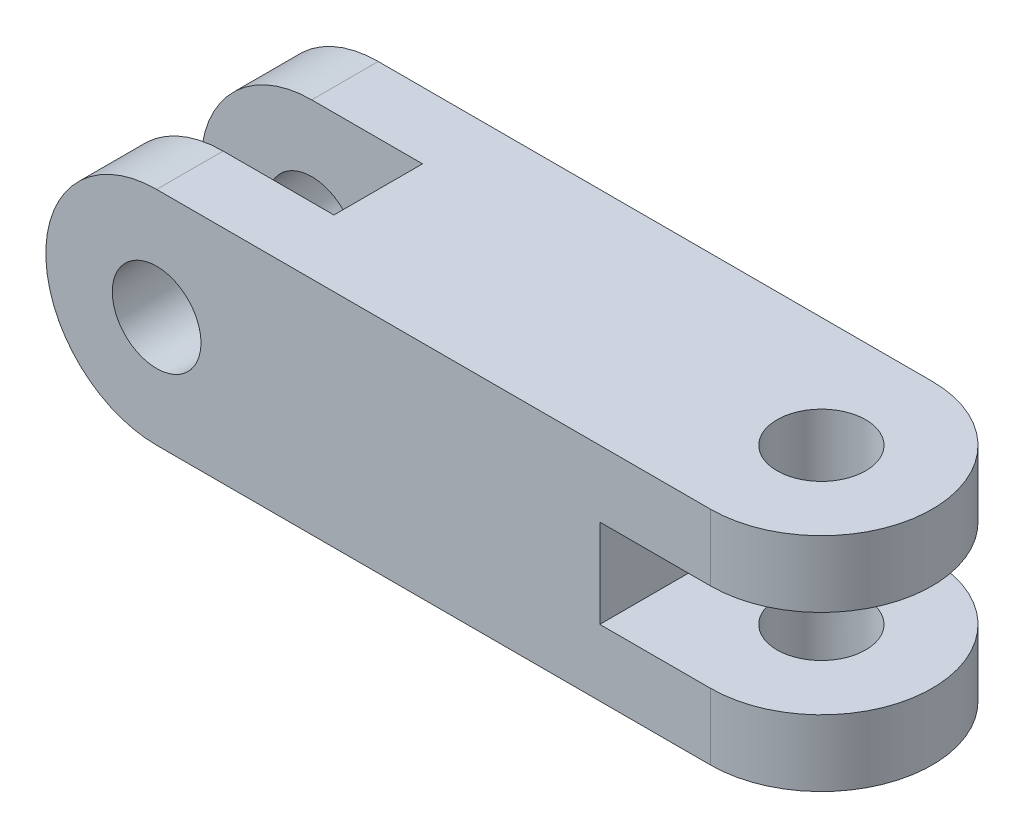
ISO-10303-21;
HEADER;
FILE_DESCRIPTION(('STEP AP214'),'2;1');
FILE_NAME('part.step','',(''),(''),'','','');
FILE_SCHEMA(('AUTOMOTIVE_DESIGN { 1 0 10303 214 1 1 1 1 }'));
ENDSEC;
DATA;
#1=APPLICATION_CONTEXT('core data for automotive mechanical design processes');
#2=APPLICATION_PROTOCOL_DEFINITION('international standard','automotive_design',2000,#1);
#3=PRODUCT_CONTEXT('',#1,'mechanical');
#4=PRODUCT('Part','Part','',(#3));
#5=PRODUCT_RELATED_PRODUCT_CATEGORY('part','',(#4));
#6=PRODUCT_DEFINITION_FORMATION('','',#4);
#7=PRODUCT_DEFINITION_CONTEXT('part definition',#1,'design');
#8=PRODUCT_DEFINITION('design','',#6,#7);
#9=PRODUCT_DEFINITION_SHAPE('','',#8);
#10=(LENGTH_UNIT() NAMED_UNIT(*) SI_UNIT(.MILLI.,.METRE.));
#11=(NAMED_UNIT(*) PLANE_ANGLE_UNIT() SI_UNIT($,.RADIAN.));
#12=(NAMED_UNIT(*) SI_UNIT($,.STERADIAN.) SOLID_ANGLE_UNIT());
#13=UNCERTAINTY_MEASURE_WITH_UNIT(LENGTH_MEASURE(1.E-05),#10,'distance_accuracy_value','');
#14=(GEOMETRIC_REPRESENTATION_CONTEXT(3) GLOBAL_UNCERTAINTY_ASSIGNED_CONTEXT((#13)) GLOBAL_UNIT_ASSIGNED_CONTEXT((#10,
#11,#12)) REPRESENTATION_CONTEXT('',''));
#15=CARTESIAN_POINT('',(0.,0.,0.));
#16=DIRECTION('',(0.,0.,1.));
#17=DIRECTION('',(1.,0.,0.));
#18=AXIS2_PLACEMENT_3D('',#15,#16,#17);
#19=CARTESIAN_POINT('',(65.,50.,0.));
#20=DIRECTION('',(0.,-1.,0.));
#21=DIRECTION('',(0.,0.,-1.));
#22=AXIS2_PLACEMENT_3D('',#19,#20,#21);
#23=CYLINDRICAL_SURFACE('',#22,25.);
#24=DIRECTION('',(0.,-1.,0.));
#25=VECTOR('',#24,1.);
#26=CARTESIAN_POINT('',(65.,50.,-25.));
#27=LINE('',#26,#25);
#28=CARTESIAN_POINT('',(65.,15.,-25.));
#29=VERTEX_POINT('',#28);
#30=CARTESIAN_POINT('',(65.,0.,-25.));
#31=VERTEX_POINT('',#30);
#32=EDGE_CURVE('E214',#29,#31,#27,.T.);
#33=ORIENTED_EDGE('',*,*,#32,.F.);
#34=CARTESIAN_POINT('',(65.,15.,0.));
#35=DIRECTION('',(0.,-1.,0.));
#36=DIRECTION('',(0.,0.,-1.));
#37=AXIS2_PLACEMENT_3D('',#34,#35,#36);
#38=CIRCLE('',#37,25.);
#39=CARTESIAN_POINT('',(65.,15.,25.));
#40=VERTEX_POINT('',#39);
#41=EDGE_CURVE('E164',#29,#40,#38,.T.);
#42=ORIENTED_EDGE('',*,*,#41,.T.);
#43=DIRECTION('',(0.,-1.,0.));
#44=VECTOR('',#43,1.);
#45=CARTESIAN_POINT('',(65.,50.,25.));
#46=LINE('',#45,#44);
#47=CARTESIAN_POINT('',(65.,0.,25.));
#48=VERTEX_POINT('',#47);
#49=EDGE_CURVE('E77',#40,#48,#46,.T.);
#50=ORIENTED_EDGE('',*,*,#49,.T.);
#51=CARTESIAN_POINT('',(65.,0.,0.));
#52=DIRECTION('',(0.,1.,0.));
#53=DIRECTION('',(0.,0.,1.));
#54=AXIS2_PLACEMENT_3D('',#51,#52,#53);
#55=CIRCLE('',#54,25.);
#56=EDGE_CURVE('E191',#48,#31,#55,.T.);
#57=ORIENTED_EDGE('',*,*,#56,.T.);
#58=EDGE_LOOP('',(#33,#42,#50,#57));
#59=FACE_BOUND('',#58,.T.);
#60=ADVANCED_FACE('F33',(#59),#23,.T.);
#61=CARTESIAN_POINT('',(-60.,25.,-25.));
#62=DIRECTION('',(0.,0.,1.));
#63=DIRECTION('',(1.,0.,0.));
#64=AXIS2_PLACEMENT_3D('',#61,#62,#63);
#65=CYLINDRICAL_SURFACE('',#64,25.);
#66=DIRECTION('',(0.,0.,1.));
#67=VECTOR('',#66,1.);
#68=CARTESIAN_POINT('',(-60.,0.,-25.));
#69=LINE('',#68,#67);
#70=CARTESIAN_POINT('',(-60.,0.,-25.));
#71=VERTEX_POINT('',#70);
#72=CARTESIAN_POINT('',(-60.,0.,-10.));
#73=VERTEX_POINT('',#72);
#74=EDGE_CURVE('E207',#71,#73,#69,.T.);
#75=ORIENTED_EDGE('',*,*,#74,.T.);
#76=CARTESIAN_POINT('',(-60.,25.,-10.));
#77=DIRECTION('',(0.,0.,-1.));
#78=DIRECTION('',(-1.,0.,0.));
#79=AXIS2_PLACEMENT_3D('',#76,#77,#78);
#80=CIRCLE('',#79,25.);
#81=CARTESIAN_POINT('',(-60.,50.,-10.));
#82=VERTEX_POINT('',#81);
#83=EDGE_CURVE('E42',#82,#73,#80,.F.);
#84=ORIENTED_EDGE('',*,*,#83,.F.);
#85=DIRECTION('',(0.,0.,1.));
#86=VECTOR('',#85,1.);
#87=CARTESIAN_POINT('',(-60.,50.,-25.));
#88=LINE('',#87,#86);
#89=CARTESIAN_POINT('',(-60.,50.,-25.));
#90=VERTEX_POINT('',#89);
#91=EDGE_CURVE('E199',#90,#82,#88,.T.);
#92=ORIENTED_EDGE('',*,*,#91,.F.);
#93=CARTESIAN_POINT('',(-60.,25.,-25.));
#94=DIRECTION('',(0.,0.,1.));
#95=DIRECTION('',(1.,0.,0.));
#96=AXIS2_PLACEMENT_3D('',#93,#94,#95);
#97=CIRCLE('',#96,25.);
#98=EDGE_CURVE('E188',#90,#71,#97,.T.);
#99=ORIENTED_EDGE('',*,*,#98,.T.);
#100=EDGE_LOOP('',(#75,#84,#92,#99));
#101=FACE_BOUND('',#100,.T.);
#102=ADVANCED_FACE('F262',(#101),#65,.T.);
#103=CARTESIAN_POINT('',(65.,50.,25.));
#104=VERTEX_POINT('',#103);
#105=CARTESIAN_POINT('',(65.,35.,25.));
#106=VERTEX_POINT('',#105);
#107=EDGE_CURVE('E211',#104,#106,#46,.T.);
#108=ORIENTED_EDGE('',*,*,#107,.T.);
#109=CARTESIAN_POINT('',(65.,35.,0.));
#110=DIRECTION('',(0.,1.,0.));
#111=DIRECTION('',(0.,0.,1.));
#112=AXIS2_PLACEMENT_3D('',#109,#110,#111);
#113=CIRCLE('',#112,25.);
#114=CARTESIAN_POINT('',(65.,35.,-25.));
#115=VERTEX_POINT('',#114);
#116=EDGE_CURVE('E50',#106,#115,#113,.T.);
#117=ORIENTED_EDGE('',*,*,#116,.T.);
#118=CARTESIAN_POINT('',(65.,50.,-25.));
#119=VERTEX_POINT('',#118);
#120=EDGE_CURVE('E150',#119,#115,#27,.T.);
#121=ORIENTED_EDGE('',*,*,#120,.F.);
#122=CARTESIAN_POINT('',(65.,50.,0.));
#123=DIRECTION('',(0.,1.,0.));
#124=DIRECTION('',(0.,0.,1.));
#125=AXIS2_PLACEMENT_3D('',#122,#123,#124);
#126=CIRCLE('',#125,25.);
#127=EDGE_CURVE('E194',#104,#119,#126,.T.);
#128=ORIENTED_EDGE('',*,*,#127,.F.);
#129=EDGE_LOOP('',(#108,#117,#121,#128));
#130=FACE_BOUND('',#129,.T.);
#131=ADVANCED_FACE('F35',(#130),#23,.T.);
#132=CARTESIAN_POINT('',(-60.,50.,-25.));
#133=DIRECTION('',(0.,0.,1.));
#134=DIRECTION('',(1.,0.,0.));
#135=AXIS2_PLACEMENT_3D('',#132,#133,#134);
#136=PLANE('',#135);
#137=CARTESIAN_POINT('',(-60.,25.,-25.));
#138=DIRECTION('',(0.,0.,-1.));
#139=DIRECTION('',(-1.,0.,0.));
#140=AXIS2_PLACEMENT_3D('',#137,#138,#139);
#141=CIRCLE('',#140,9.99999999999999);
#142=CARTESIAN_POINT('',(-70.,25.,-25.));
#143=VERTEX_POINT('',#142);
#144=EDGE_CURVE('E234',#143,#143,#141,.T.);
#145=ORIENTED_EDGE('',*,*,#144,.F.);
#146=EDGE_LOOP('',(#145));
#147=FACE_BOUND('',#146,.T.);
#148=DIRECTION('',(0.,-1.,0.));
#149=VECTOR('',#148,1.);
#150=CARTESIAN_POINT('',(40.,35.,-25.));
#151=LINE('',#150,#149);
#152=CARTESIAN_POINT('',(40.,35.,-25.));
#153=VERTEX_POINT('',#152);
#154=CARTESIAN_POINT('',(40.,15.,-25.));
#155=VERTEX_POINT('',#154);
#156=EDGE_CURVE('E143',#153,#155,#151,.T.);
#157=ORIENTED_EDGE('',*,*,#156,.T.);
#158=DIRECTION('',(1.,0.,0.));
#159=VECTOR('',#158,1.);
#160=CARTESIAN_POINT('',(90.,15.,-25.));
#161=LINE('',#160,#159);
#162=EDGE_CURVE('E140',#155,#29,#161,.T.);
#163=ORIENTED_EDGE('',*,*,#162,.T.);
#164=ORIENTED_EDGE('',*,*,#32,.T.);
#165=DIRECTION('',(-1.,0.,0.));
#166=VECTOR('',#165,1.);
#167=CARTESIAN_POINT('',(-60.,0.,-25.));
#168=LINE('',#167,#166);
#169=EDGE_CURVE('E204',#31,#71,#168,.T.);
#170=ORIENTED_EDGE('',*,*,#169,.T.);
#171=ORIENTED_EDGE('',*,*,#98,.F.);
#172=DIRECTION('',(-1.,0.,0.));
#173=VECTOR('',#172,1.);
#174=CARTESIAN_POINT('',(-60.,50.,-25.));
#175=LINE('',#174,#173);
#176=EDGE_CURVE('E85',#119,#90,#175,.T.);
#177=ORIENTED_EDGE('',*,*,#176,.F.);
#178=ORIENTED_EDGE('',*,*,#120,.T.);
#179=DIRECTION('',(-1.,0.,0.));
#180=VECTOR('',#179,1.);
#181=CARTESIAN_POINT('',(90.,35.,-25.));
#182=LINE('',#181,#180);
#183=EDGE_CURVE('E135',#115,#153,#182,.T.);
#184=ORIENTED_EDGE('',*,*,#183,.T.);
#185=EDGE_LOOP('',(#157,#163,#164,#170,#171,#177,#178,#184));
#186=FACE_BOUND('',#185,.T.);
#187=ADVANCED_FACE('F148',(#147,#186),#136,.F.);
#188=CARTESIAN_POINT('',(-60.,50.,25.));
#189=DIRECTION('',(0.,0.,-1.));
#190=DIRECTION('',(-1.,0.,0.));
#191=AXIS2_PLACEMENT_3D('',#188,#189,#190);
#192=PLANE('',#191);
#193=CARTESIAN_POINT('',(-60.,25.,25.));
#194=DIRECTION('',(0.,0.,-1.));
#195=DIRECTION('',(-1.,0.,0.));
#196=AXIS2_PLACEMENT_3D('',#193,#194,#195);
#197=CIRCLE('',#196,9.99999999999999);
#198=CARTESIAN_POINT('',(-70.,25.,25.));
#199=VERTEX_POINT('',#198);
#200=EDGE_CURVE('E237',#199,#199,#197,.T.);
#201=ORIENTED_EDGE('',*,*,#200,.T.);
#202=EDGE_LOOP('',(#201));
#203=FACE_BOUND('',#202,.T.);
#204=ORIENTED_EDGE('',*,*,#49,.F.);
#205=DIRECTION('',(1.,0.,0.));
#206=VECTOR('',#205,1.);
#207=CARTESIAN_POINT('',(90.,15.,25.));
#208=LINE('',#207,#206);
#209=CARTESIAN_POINT('',(40.,15.,25.));
#210=VERTEX_POINT('',#209);
#211=EDGE_CURVE('E151',#210,#40,#208,.T.);
#212=ORIENTED_EDGE('',*,*,#211,.F.);
#213=DIRECTION('',(0.,-1.,0.));
#214=VECTOR('',#213,1.);
#215=CARTESIAN_POINT('',(40.,35.,25.));
#216=LINE('',#215,#214);
#217=CARTESIAN_POINT('',(40.,35.,25.));
#218=VERTEX_POINT('',#217);
#219=EDGE_CURVE('E154',#218,#210,#216,.T.);
#220=ORIENTED_EDGE('',*,*,#219,.F.);
#221=DIRECTION('',(1.,0.,0.));
#222=VECTOR('',#221,1.);
#223=CARTESIAN_POINT('',(-60.,35.,25.));
#224=LINE('',#223,#222);
#225=EDGE_CURVE('E11',#218,#106,#224,.T.);
#226=ORIENTED_EDGE('',*,*,#225,.T.);
#227=ORIENTED_EDGE('',*,*,#107,.F.);
#228=DIRECTION('',(1.,0.,0.));
#229=VECTOR('',#228,1.);
#230=CARTESIAN_POINT('',(-60.,50.,25.));
#231=LINE('',#230,#229);
#232=CARTESIAN_POINT('',(-60.,50.,25.));
#233=VERTEX_POINT('',#232);
#234=EDGE_CURVE('E58',#233,#104,#231,.T.);
#235=ORIENTED_EDGE('',*,*,#234,.F.);
#236=CARTESIAN_POINT('',(-60.,25.,25.));
#237=DIRECTION('',(0.,0.,1.));
#238=DIRECTION('',(1.,0.,0.));
#239=AXIS2_PLACEMENT_3D('',#236,#237,#238);
#240=CIRCLE('',#239,25.);
#241=CARTESIAN_POINT('',(-60.,0.,25.));
#242=VERTEX_POINT('',#241);
#243=EDGE_CURVE('E185',#233,#242,#240,.T.);
#244=ORIENTED_EDGE('',*,*,#243,.T.);
#245=DIRECTION('',(1.,0.,0.));
#246=VECTOR('',#245,1.);
#247=CARTESIAN_POINT('',(-60.,0.,25.));
#248=LINE('',#247,#246);
#249=EDGE_CURVE('E196',#242,#48,#248,.T.);
#250=ORIENTED_EDGE('',*,*,#249,.T.);
#251=EDGE_LOOP('',(#204,#212,#220,#226,#227,#235,#244,#250));
#252=FACE_BOUND('',#251,.T.);
#253=ADVANCED_FACE('F275',(#203,#252),#192,.F.);
#254=CARTESIAN_POINT('',(65.,50.,0.));
#255=DIRECTION('',(0.,1.,0.));
#256=DIRECTION('',(0.,0.,1.));
#257=AXIS2_PLACEMENT_3D('',#254,#255,#256);
#258=PLANE('',#257);
#259=CARTESIAN_POINT('',(65.,50.,0.));
#260=DIRECTION('',(0.,1.,0.));
#261=DIRECTION('',(0.,0.,1.));
#262=AXIS2_PLACEMENT_3D('',#259,#260,#261);
#263=CIRCLE('',#262,9.99999999999999);
#264=CARTESIAN_POINT('',(65.,50.,9.99999999999999));
#265=VERTEX_POINT('',#264);
#266=EDGE_CURVE('E225',#265,#265,#263,.T.);
#267=ORIENTED_EDGE('',*,*,#266,.F.);
#268=EDGE_LOOP('',(#267));
#269=FACE_BOUND('',#268,.T.);
#270=DIRECTION('',(-1.,0.,0.));
#271=VECTOR('',#270,1.);
#272=CARTESIAN_POINT('',(-85.,50.,-10.));
#273=LINE('',#272,#271);
#274=CARTESIAN_POINT('',(-35.,50.,-10.));
#275=VERTEX_POINT('',#274);
#276=EDGE_CURVE('E171',#275,#82,#273,.T.);
#277=ORIENTED_EDGE('',*,*,#276,.F.);
#278=DIRECTION('',(0.,0.,-1.));
#279=VECTOR('',#278,1.);
#280=CARTESIAN_POINT('',(-35.,50.,-10.));
#281=LINE('',#280,#279);
#282=CARTESIAN_POINT('',(-35.,50.,9.99999999999999));
#283=VERTEX_POINT('',#282);
#284=EDGE_CURVE('E179',#283,#275,#281,.T.);
#285=ORIENTED_EDGE('',*,*,#284,.F.);
#286=DIRECTION('',(1.,0.,0.));
#287=VECTOR('',#286,1.);
#288=CARTESIAN_POINT('',(-85.,50.,9.99999999999999));
#289=LINE('',#288,#287);
#290=CARTESIAN_POINT('',(-60.,50.,9.99999999999999));
#291=VERTEX_POINT('',#290);
#292=EDGE_CURVE('E166',#291,#283,#289,.T.);
#293=ORIENTED_EDGE('',*,*,#292,.F.);
#294=EDGE_CURVE('E198',#291,#233,#88,.T.);
#295=ORIENTED_EDGE('',*,*,#294,.T.);
#296=ORIENTED_EDGE('',*,*,#234,.T.);
#297=ORIENTED_EDGE('',*,*,#127,.T.);
#298=ORIENTED_EDGE('',*,*,#176,.T.);
#299=ORIENTED_EDGE('',*,*,#91,.T.);
#300=EDGE_LOOP('',(#277,#285,#293,#295,#296,#297,#298,#299));
#301=FACE_BOUND('',#300,.T.);
#302=ADVANCED_FACE('F293',(#269,#301),#258,.T.);
#303=CARTESIAN_POINT('',(65.,0.,0.));
#304=DIRECTION('',(0.,1.,0.));
#305=DIRECTION('',(0.,0.,1.));
#306=AXIS2_PLACEMENT_3D('',#303,#304,#305);
#307=PLANE('',#306);
#308=CARTESIAN_POINT('',(65.,0.,0.));
#309=DIRECTION('',(0.,1.,0.));
#310=DIRECTION('',(0.,0.,1.));
#311=AXIS2_PLACEMENT_3D('',#308,#309,#310);
#312=CIRCLE('',#311,9.99999999999999);
#313=CARTESIAN_POINT('',(65.,0.,9.99999999999999));
#314=VERTEX_POINT('',#313);
#315=EDGE_CURVE('E220',#314,#314,#312,.T.);
#316=ORIENTED_EDGE('',*,*,#315,.T.);
#317=EDGE_LOOP('',(#316));
#318=FACE_BOUND('',#317,.T.);
#319=DIRECTION('',(0.,0.,-1.));
#320=VECTOR('',#319,1.);
#321=CARTESIAN_POINT('',(-35.,0.,-10.));
#322=LINE('',#321,#320);
#323=CARTESIAN_POINT('',(-35.,0.,9.99999999999999));
#324=VERTEX_POINT('',#323);
#325=CARTESIAN_POINT('',(-35.,0.,-10.));
#326=VERTEX_POINT('',#325);
#327=EDGE_CURVE('E170',#324,#326,#322,.T.);
#328=ORIENTED_EDGE('',*,*,#327,.T.);
#329=DIRECTION('',(-1.,0.,0.));
#330=VECTOR('',#329,1.);
#331=CARTESIAN_POINT('',(-85.,0.,-10.));
#332=LINE('',#331,#330);
#333=EDGE_CURVE('E174',#326,#73,#332,.T.);
#334=ORIENTED_EDGE('',*,*,#333,.T.);
#335=ORIENTED_EDGE('',*,*,#74,.F.);
#336=ORIENTED_EDGE('',*,*,#169,.F.);
#337=ORIENTED_EDGE('',*,*,#56,.F.);
#338=ORIENTED_EDGE('',*,*,#249,.F.);
#339=CARTESIAN_POINT('',(-60.,0.,9.99999999999999));
#340=VERTEX_POINT('',#339);
#341=EDGE_CURVE('E206',#340,#242,#69,.T.);
#342=ORIENTED_EDGE('',*,*,#341,.F.);
#343=DIRECTION('',(1.,0.,0.));
#344=VECTOR('',#343,1.);
#345=CARTESIAN_POINT('',(-85.,0.,9.99999999999999));
#346=LINE('',#345,#344);
#347=EDGE_CURVE('E167',#340,#324,#346,.T.);
#348=ORIENTED_EDGE('',*,*,#347,.T.);
#349=EDGE_LOOP('',(#328,#334,#335,#336,#337,#338,#342,#348));
#350=FACE_BOUND('',#349,.T.);
#351=ADVANCED_FACE('F287',(#318,#350),#307,.F.);
#352=CARTESIAN_POINT('',(-60.,25.,9.99999999999999));
#353=DIRECTION('',(0.,0.,1.));
#354=DIRECTION('',(1.,0.,0.));
#355=AXIS2_PLACEMENT_3D('',#352,#353,#354);
#356=CIRCLE('',#355,25.);
#357=EDGE_CURVE('E216',#340,#291,#356,.F.);
#358=ORIENTED_EDGE('',*,*,#357,.F.);
#359=ORIENTED_EDGE('',*,*,#341,.T.);
#360=ORIENTED_EDGE('',*,*,#243,.F.);
#361=ORIENTED_EDGE('',*,*,#294,.F.);
#362=EDGE_LOOP('',(#358,#359,#360,#361));
#363=FACE_BOUND('',#362,.T.);
#364=ADVANCED_FACE('F268',(#363),#65,.T.);
#365=CARTESIAN_POINT('',(-85.,0.,-10.));
#366=DIRECTION('',(0.,0.,-1.));
#367=DIRECTION('',(-1.,0.,0.));
#368=AXIS2_PLACEMENT_3D('',#365,#366,#367);
#369=PLANE('',#368);
#370=CARTESIAN_POINT('',(-60.,25.,-10.));
#371=DIRECTION('',(0.,0.,-1.));
#372=DIRECTION('',(-1.,0.,0.));
#373=AXIS2_PLACEMENT_3D('',#370,#371,#372);
#374=CIRCLE('',#373,9.99999999999999);
#375=CARTESIAN_POINT('',(-70.,25.,-10.));
#376=VERTEX_POINT('',#375);
#377=EDGE_CURVE('E230',#376,#376,#374,.T.);
#378=ORIENTED_EDGE('',*,*,#377,.T.);
#379=EDGE_LOOP('',(#378));
#380=FACE_BOUND('',#379,.T.);
#381=ORIENTED_EDGE('',*,*,#83,.T.);
#382=ORIENTED_EDGE('',*,*,#333,.F.);
#383=DIRECTION('',(0.,1.,0.));
#384=VECTOR('',#383,1.);
#385=CARTESIAN_POINT('',(-35.,0.,-10.));
#386=LINE('',#385,#384);
#387=EDGE_CURVE('E183',#326,#275,#386,.T.);
#388=ORIENTED_EDGE('',*,*,#387,.T.);
#389=ORIENTED_EDGE('',*,*,#276,.T.);
#390=EDGE_LOOP('',(#381,#382,#388,#389));
#391=FACE_BOUND('',#390,.T.);
#392=ADVANCED_FACE('F297',(#380,#391),#369,.F.);
#393=CARTESIAN_POINT('',(-35.,0.,-10.));
#394=DIRECTION('',(1.,0.,0.));
#395=DIRECTION('',(0.,0.,-1.));
#396=AXIS2_PLACEMENT_3D('',#393,#394,#395);
#397=PLANE('',#396);
#398=ORIENTED_EDGE('',*,*,#284,.T.);
#399=ORIENTED_EDGE('',*,*,#387,.F.);
#400=ORIENTED_EDGE('',*,*,#327,.F.);
#401=DIRECTION('',(0.,1.,0.));
#402=VECTOR('',#401,1.);
#403=CARTESIAN_POINT('',(-35.,0.,9.99999999999999));
#404=LINE('',#403,#402);
#405=EDGE_CURVE('E177',#324,#283,#404,.T.);
#406=ORIENTED_EDGE('',*,*,#405,.T.);
#407=EDGE_LOOP('',(#398,#399,#400,#406));
#408=FACE_BOUND('',#407,.T.);
#409=ADVANCED_FACE('F301',(#408),#397,.F.);
#410=CARTESIAN_POINT('',(-85.,0.,9.99999999999999));
#411=DIRECTION('',(0.,0.,1.));
#412=DIRECTION('',(1.,0.,0.));
#413=AXIS2_PLACEMENT_3D('',#410,#411,#412);
#414=PLANE('',#413);
#415=CARTESIAN_POINT('',(-60.,25.,9.99999999999999));
#416=DIRECTION('',(0.,0.,1.));
#417=DIRECTION('',(1.,0.,0.));
#418=AXIS2_PLACEMENT_3D('',#415,#416,#417);
#419=CIRCLE('',#418,9.99999999999999);
#420=CARTESIAN_POINT('',(-50.,25.,9.99999999999999));
#421=VERTEX_POINT('',#420);
#422=EDGE_CURVE('E37',#421,#421,#419,.T.);
#423=ORIENTED_EDGE('',*,*,#422,.T.);
#424=EDGE_LOOP('',(#423));
#425=FACE_BOUND('',#424,.T.);
#426=ORIENTED_EDGE('',*,*,#347,.F.);
#427=ORIENTED_EDGE('',*,*,#357,.T.);
#428=ORIENTED_EDGE('',*,*,#292,.T.);
#429=ORIENTED_EDGE('',*,*,#405,.F.);
#430=EDGE_LOOP('',(#426,#427,#428,#429));
#431=FACE_BOUND('',#430,.T.);
#432=ADVANCED_FACE('F244',(#425,#431),#414,.F.);
#433=CARTESIAN_POINT('',(90.,15.,-25.));
#434=DIRECTION('',(0.,-1.,0.));
#435=DIRECTION('',(0.,0.,-1.));
#436=AXIS2_PLACEMENT_3D('',#433,#434,#435);
#437=PLANE('',#436);
#438=CARTESIAN_POINT('',(65.,15.,0.));
#439=DIRECTION('',(0.,-1.,0.));
#440=DIRECTION('',(0.,0.,-1.));
#441=AXIS2_PLACEMENT_3D('',#438,#439,#440);
#442=CIRCLE('',#441,9.99999999999999);
#443=CARTESIAN_POINT('',(65.,15.,-10.));
#444=VERTEX_POINT('',#443);
#445=EDGE_CURVE('E157',#444,#444,#442,.T.);
#446=ORIENTED_EDGE('',*,*,#445,.T.);
#447=EDGE_LOOP('',(#446));
#448=FACE_BOUND('',#447,.T.);
#449=ORIENTED_EDGE('',*,*,#162,.F.);
#450=DIRECTION('',(0.,0.,1.));
#451=VECTOR('',#450,1.);
#452=CARTESIAN_POINT('',(40.,15.,-25.));
#453=LINE('',#452,#451);
#454=EDGE_CURVE('E139',#155,#210,#453,.T.);
#455=ORIENTED_EDGE('',*,*,#454,.T.);
#456=ORIENTED_EDGE('',*,*,#211,.T.);
#457=ORIENTED_EDGE('',*,*,#41,.F.);
#458=EDGE_LOOP('',(#449,#455,#456,#457));
#459=FACE_BOUND('',#458,.T.);
#460=ADVANCED_FACE('F282',(#448,#459),#437,.F.);
#461=CARTESIAN_POINT('',(90.,35.,-25.));
#462=DIRECTION('',(0.,1.,0.));
#463=DIRECTION('',(0.,0.,1.));
#464=AXIS2_PLACEMENT_3D('',#461,#462,#463);
#465=PLANE('',#464);
#466=CARTESIAN_POINT('',(65.,35.,0.));
#467=DIRECTION('',(0.,1.,0.));
#468=DIRECTION('',(0.,0.,1.));
#469=AXIS2_PLACEMENT_3D('',#466,#467,#468);
#470=CIRCLE('',#469,9.99999999999999);
#471=CARTESIAN_POINT('',(65.,35.,9.99999999999999));
#472=VERTEX_POINT('',#471);
#473=EDGE_CURVE('E218',#472,#472,#470,.T.);
#474=ORIENTED_EDGE('',*,*,#473,.T.);
#475=EDGE_LOOP('',(#474));
#476=FACE_BOUND('',#475,.T.);
#477=ORIENTED_EDGE('',*,*,#225,.F.);
#478=DIRECTION('',(0.,0.,1.));
#479=VECTOR('',#478,1.);
#480=CARTESIAN_POINT('',(40.,35.,-25.));
#481=LINE('',#480,#479);
#482=EDGE_CURVE('E131',#153,#218,#481,.T.);
#483=ORIENTED_EDGE('',*,*,#482,.F.);
#484=ORIENTED_EDGE('',*,*,#183,.F.);
#485=ORIENTED_EDGE('',*,*,#116,.F.);
#486=EDGE_LOOP('',(#477,#483,#484,#485));
#487=FACE_BOUND('',#486,.T.);
#488=ADVANCED_FACE('F133',(#476,#487),#465,.F.);
#489=CARTESIAN_POINT('',(40.,35.,-25.));
#490=DIRECTION('',(-1.,0.,0.));
#491=DIRECTION('',(0.,0.,1.));
#492=AXIS2_PLACEMENT_3D('',#489,#490,#491);
#493=PLANE('',#492);
#494=ORIENTED_EDGE('',*,*,#219,.T.);
#495=ORIENTED_EDGE('',*,*,#454,.F.);
#496=ORIENTED_EDGE('',*,*,#156,.F.);
#497=ORIENTED_EDGE('',*,*,#482,.T.);
#498=EDGE_LOOP('',(#494,#495,#496,#497));
#499=FACE_BOUND('',#498,.T.);
#500=ADVANCED_FACE('F144',(#499),#493,.F.);
#501=CARTESIAN_POINT('',(65.,0.,0.));
#502=DIRECTION('',(0.,1.,0.));
#503=DIRECTION('',(0.,0.,1.));
#504=AXIS2_PLACEMENT_3D('',#501,#502,#503);
#505=CYLINDRICAL_SURFACE('',#504,9.99999999999999);
#506=ORIENTED_EDGE('',*,*,#266,.T.);
#507=EDGE_LOOP('',(#506));
#508=FACE_BOUND('',#507,.T.);
#509=ORIENTED_EDGE('',*,*,#473,.F.);
#510=EDGE_LOOP('',(#509));
#511=FACE_BOUND('',#510,.T.);
#512=ADVANCED_FACE('F258',(#508,#511),#505,.F.);
#513=ORIENTED_EDGE('',*,*,#315,.F.);
#514=EDGE_LOOP('',(#513));
#515=FACE_BOUND('',#514,.T.);
#516=ORIENTED_EDGE('',*,*,#445,.F.);
#517=EDGE_LOOP('',(#516));
#518=FACE_BOUND('',#517,.T.);
#519=ADVANCED_FACE('F250',(#515,#518),#505,.F.);
#520=CARTESIAN_POINT('',(-60.,25.,25.));
#521=DIRECTION('',(0.,0.,-1.));
#522=DIRECTION('',(-1.,0.,0.));
#523=AXIS2_PLACEMENT_3D('',#520,#521,#522);
#524=CYLINDRICAL_SURFACE('',#523,9.99999999999999);
#525=ORIENTED_EDGE('',*,*,#200,.F.);
#526=EDGE_LOOP('',(#525));
#527=FACE_BOUND('',#526,.T.);
#528=ORIENTED_EDGE('',*,*,#422,.F.);
#529=EDGE_LOOP('',(#528));
#530=FACE_BOUND('',#529,.T.);
#531=ADVANCED_FACE('F247',(#527,#530),#524,.F.);
#532=ORIENTED_EDGE('',*,*,#144,.T.);
#533=EDGE_LOOP('',(#532));
#534=FACE_BOUND('',#533,.T.);
#535=ORIENTED_EDGE('',*,*,#377,.F.);
#536=EDGE_LOOP('',(#535));
#537=FACE_BOUND('',#536,.T.);
#538=ADVANCED_FACE('F249',(#534,#537),#524,.F.);
#539=CLOSED_SHELL('',(#60,#102,#131,#187,#253,#302,#351,#364,#392,#409,#432,#460,#488,#500,#512,
#519,#531,#538));
#540=MANIFOLD_SOLID_BREP('B2',#539);
#541=ADVANCED_BREP_SHAPE_REPRESENTATION('',(#18,#540),#14);
#542=SHAPE_DEFINITION_REPRESENTATION(#9,#541);
ENDSEC;
END-ISO-10303-21;
